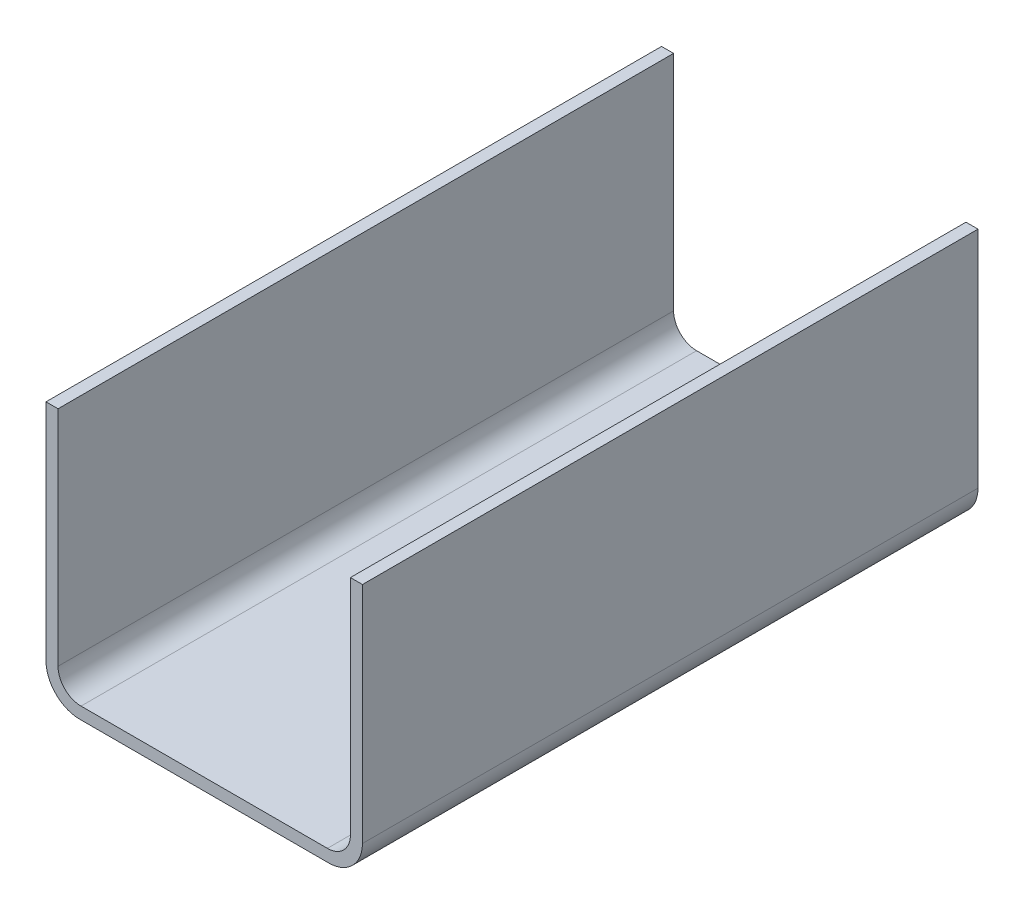
ISO-10303-21;
HEADER;
FILE_DESCRIPTION(('STEP AP214'),'2;1');
FILE_NAME('part.step','',(''),(''),'','','');
FILE_SCHEMA(('AUTOMOTIVE_DESIGN { 1 0 10303 214 1 1 1 1 }'));
ENDSEC;
DATA;
#1=APPLICATION_CONTEXT('core data for automotive mechanical design processes');
#2=APPLICATION_PROTOCOL_DEFINITION('international standard','automotive_design',2000,#1);
#3=PRODUCT_CONTEXT('',#1,'mechanical');
#4=PRODUCT('Part','Part','',(#3));
#5=PRODUCT_RELATED_PRODUCT_CATEGORY('part','',(#4));
#6=PRODUCT_DEFINITION_FORMATION('','',#4);
#7=PRODUCT_DEFINITION_CONTEXT('part definition',#1,'design');
#8=PRODUCT_DEFINITION('design','',#6,#7);
#9=PRODUCT_DEFINITION_SHAPE('','',#8);
#10=(LENGTH_UNIT() NAMED_UNIT(*) SI_UNIT(.MILLI.,.METRE.));
#11=(NAMED_UNIT(*) PLANE_ANGLE_UNIT() SI_UNIT($,.RADIAN.));
#12=(NAMED_UNIT(*) SI_UNIT($,.STERADIAN.) SOLID_ANGLE_UNIT());
#13=UNCERTAINTY_MEASURE_WITH_UNIT(LENGTH_MEASURE(1.E-05),#10,'distance_accuracy_value','');
#14=(GEOMETRIC_REPRESENTATION_CONTEXT(3) GLOBAL_UNCERTAINTY_ASSIGNED_CONTEXT((#13)) GLOBAL_UNIT_ASSIGNED_CONTEXT((#10,
#11,#12)) REPRESENTATION_CONTEXT('',''));
#15=CARTESIAN_POINT('',(0.,0.,0.));
#16=DIRECTION('',(0.,0.,1.));
#17=DIRECTION('',(1.,0.,0.));
#18=AXIS2_PLACEMENT_3D('',#15,#16,#17);
#19=CARTESIAN_POINT('',(95.35,84.15,401.5));
#20=DIRECTION('',(0.,-1.,0.));
#21=DIRECTION('',(1.,0.,0.));
#22=AXIS2_PLACEMENT_3D('',#19,#20,#21);
#23=PLANE('',#22);
#24=DIRECTION('',(-1.,0.,0.));
#25=VECTOR('',#24,1.);
#26=CARTESIAN_POINT('',(95.35,84.15,0.));
#27=LINE('',#26,#25);
#28=CARTESIAN_POINT('',(103.2,84.15,0.));
#29=VERTEX_POINT('',#28);
#30=CARTESIAN_POINT('',(95.35,84.15,0.));
#31=VERTEX_POINT('',#30);
#32=EDGE_CURVE('E148',#29,#31,#27,.T.);
#33=ORIENTED_EDGE('',*,*,#32,.T.);
#34=DIRECTION('',(0.,0.,-1.));
#35=VECTOR('',#34,1.);
#36=CARTESIAN_POINT('',(95.35,84.15,401.5));
#37=LINE('',#36,#35);
#38=CARTESIAN_POINT('',(95.35,84.15,401.5));
#39=VERTEX_POINT('',#38);
#40=EDGE_CURVE('E131',#39,#31,#37,.T.);
#41=ORIENTED_EDGE('',*,*,#40,.F.);
#42=DIRECTION('',(-1.,0.,0.));
#43=VECTOR('',#42,1.);
#44=CARTESIAN_POINT('',(95.35,84.15,401.5));
#45=LINE('',#44,#43);
#46=CARTESIAN_POINT('',(103.2,84.15,401.5));
#47=VERTEX_POINT('',#46);
#48=EDGE_CURVE('E137',#47,#39,#45,.T.);
#49=ORIENTED_EDGE('',*,*,#48,.F.);
#50=DIRECTION('',(0.,0.,-1.));
#51=VECTOR('',#50,1.);
#52=CARTESIAN_POINT('',(103.2,84.15,401.5));
#53=LINE('',#52,#51);
#54=EDGE_CURVE('E213',#47,#29,#53,.T.);
#55=ORIENTED_EDGE('',*,*,#54,.T.);
#56=EDGE_LOOP('',(#33,#41,#49,#55));
#57=FACE_BOUND('',#56,.T.);
#58=ADVANCED_FACE('F34',(#57),#23,.F.);
#59=CARTESIAN_POINT('',(95.35,-76.3,401.5));
#60=DIRECTION('',(1.,0.,0.));
#61=DIRECTION('',(0.,1.,0.));
#62=AXIS2_PLACEMENT_3D('',#59,#60,#61);
#63=PLANE('',#62);
#64=DIRECTION('',(0.,-1.,0.));
#65=VECTOR('',#64,1.);
#66=CARTESIAN_POINT('',(95.35,-76.3,0.));
#67=LINE('',#66,#65);
#68=CARTESIAN_POINT('',(95.35,-61.3,0.));
#69=VERTEX_POINT('',#68);
#70=EDGE_CURVE('E218',#31,#69,#67,.T.);
#71=ORIENTED_EDGE('',*,*,#70,.T.);
#72=DIRECTION('',(0.,0.,-1.));
#73=VECTOR('',#72,1.);
#74=CARTESIAN_POINT('',(95.35,-61.3,401.5));
#75=LINE('',#74,#73);
#76=CARTESIAN_POINT('',(95.35,-61.3,401.5));
#77=VERTEX_POINT('',#76);
#78=EDGE_CURVE('E134',#69,#77,#75,.F.);
#79=ORIENTED_EDGE('',*,*,#78,.T.);
#80=DIRECTION('',(0.,-1.,0.));
#81=VECTOR('',#80,1.);
#82=CARTESIAN_POINT('',(95.35,-76.3,401.5));
#83=LINE('',#82,#81);
#84=EDGE_CURVE('E126',#39,#77,#83,.T.);
#85=ORIENTED_EDGE('',*,*,#84,.F.);
#86=ORIENTED_EDGE('',*,*,#40,.T.);
#87=EDGE_LOOP('',(#71,#79,#85,#86));
#88=FACE_BOUND('',#87,.T.);
#89=ADVANCED_FACE('F129',(#88),#63,.F.);
#90=CARTESIAN_POINT('',(-95.35,-76.3,401.5));
#91=DIRECTION('',(0.,-1.,0.));
#92=DIRECTION('',(0.,0.,-1.));
#93=AXIS2_PLACEMENT_3D('',#90,#91,#92);
#94=PLANE('',#93);
#95=DIRECTION('',(-1.,0.,0.));
#96=VECTOR('',#95,1.);
#97=CARTESIAN_POINT('',(-95.35,-76.3,0.));
#98=LINE('',#97,#96);
#99=CARTESIAN_POINT('',(80.35,-76.3,0.));
#100=VERTEX_POINT('',#99);
#101=CARTESIAN_POINT('',(-80.35,-76.3,0.));
#102=VERTEX_POINT('',#101);
#103=EDGE_CURVE('E220',#100,#102,#98,.T.);
#104=ORIENTED_EDGE('',*,*,#103,.T.);
#105=DIRECTION('',(0.,0.,-1.));
#106=VECTOR('',#105,1.);
#107=CARTESIAN_POINT('',(-80.35,-76.3,401.5));
#108=LINE('',#107,#106);
#109=CARTESIAN_POINT('',(-80.35,-76.3,401.5));
#110=VERTEX_POINT('',#109);
#111=EDGE_CURVE('E162',#102,#110,#108,.F.);
#112=ORIENTED_EDGE('',*,*,#111,.T.);
#113=DIRECTION('',(-1.,0.,0.));
#114=VECTOR('',#113,1.);
#115=CARTESIAN_POINT('',(-95.35,-76.3,401.5));
#116=LINE('',#115,#114);
#117=CARTESIAN_POINT('',(80.35,-76.3,401.5));
#118=VERTEX_POINT('',#117);
#119=EDGE_CURVE('E136',#118,#110,#116,.T.);
#120=ORIENTED_EDGE('',*,*,#119,.F.);
#121=DIRECTION('',(0.,0.,-1.));
#122=VECTOR('',#121,1.);
#123=CARTESIAN_POINT('',(80.35,-76.3,0.));
#124=LINE('',#123,#122);
#125=EDGE_CURVE('E153',#118,#100,#124,.T.);
#126=ORIENTED_EDGE('',*,*,#125,.T.);
#127=EDGE_LOOP('',(#104,#112,#120,#126));
#128=FACE_BOUND('',#127,.T.);
#129=ADVANCED_FACE('F245',(#128),#94,.F.);
#130=CARTESIAN_POINT('',(-95.35,84.15,401.5));
#131=DIRECTION('',(-1.,0.,0.));
#132=DIRECTION('',(0.,-1.,0.));
#133=AXIS2_PLACEMENT_3D('',#130,#131,#132);
#134=PLANE('',#133);
#135=DIRECTION('',(0.,1.,0.));
#136=VECTOR('',#135,1.);
#137=CARTESIAN_POINT('',(-95.35,84.15,401.5));
#138=LINE('',#137,#136);
#139=CARTESIAN_POINT('',(-95.35,-61.3,401.5));
#140=VERTEX_POINT('',#139);
#141=CARTESIAN_POINT('',(-95.35,84.15,401.5));
#142=VERTEX_POINT('',#141);
#143=EDGE_CURVE('E232',#140,#142,#138,.T.);
#144=ORIENTED_EDGE('',*,*,#143,.F.);
#145=DIRECTION('',(0.,0.,-1.));
#146=VECTOR('',#145,1.);
#147=CARTESIAN_POINT('',(-95.35,-61.3,0.));
#148=LINE('',#147,#146);
#149=CARTESIAN_POINT('',(-95.35,-61.3,0.));
#150=VERTEX_POINT('',#149);
#151=EDGE_CURVE('E149',#140,#150,#148,.T.);
#152=ORIENTED_EDGE('',*,*,#151,.T.);
#153=DIRECTION('',(0.,1.,0.));
#154=VECTOR('',#153,1.);
#155=CARTESIAN_POINT('',(-95.35,84.15,0.));
#156=LINE('',#155,#154);
#157=CARTESIAN_POINT('',(-95.35,84.15,0.));
#158=VERTEX_POINT('',#157);
#159=EDGE_CURVE('E208',#150,#158,#156,.T.);
#160=ORIENTED_EDGE('',*,*,#159,.T.);
#161=DIRECTION('',(0.,0.,-1.));
#162=VECTOR('',#161,1.);
#163=CARTESIAN_POINT('',(-95.35,84.15,401.5));
#164=LINE('',#163,#162);
#165=EDGE_CURVE('E150',#142,#158,#164,.T.);
#166=ORIENTED_EDGE('',*,*,#165,.F.);
#167=EDGE_LOOP('',(#144,#152,#160,#166));
#168=FACE_BOUND('',#167,.T.);
#169=ADVANCED_FACE('F226',(#168),#134,.F.);
#170=CARTESIAN_POINT('',(-103.2,84.15,401.5));
#171=DIRECTION('',(0.,-1.,0.));
#172=DIRECTION('',(0.,0.,-1.));
#173=AXIS2_PLACEMENT_3D('',#170,#171,#172);
#174=PLANE('',#173);
#175=DIRECTION('',(-1.,0.,0.));
#176=VECTOR('',#175,1.);
#177=CARTESIAN_POINT('',(-103.2,84.15,0.));
#178=LINE('',#177,#176);
#179=CARTESIAN_POINT('',(-103.2,84.15,0.));
#180=VERTEX_POINT('',#179);
#181=EDGE_CURVE('E205',#158,#180,#178,.T.);
#182=ORIENTED_EDGE('',*,*,#181,.T.);
#183=DIRECTION('',(0.,0.,-1.));
#184=VECTOR('',#183,1.);
#185=CARTESIAN_POINT('',(-103.2,84.15,401.5));
#186=LINE('',#185,#184);
#187=CARTESIAN_POINT('',(-103.2,84.15,401.5));
#188=VERTEX_POINT('',#187);
#189=EDGE_CURVE('E156',#188,#180,#186,.T.);
#190=ORIENTED_EDGE('',*,*,#189,.F.);
#191=DIRECTION('',(-1.,0.,0.));
#192=VECTOR('',#191,1.);
#193=CARTESIAN_POINT('',(-103.2,84.15,401.5));
#194=LINE('',#193,#192);
#195=EDGE_CURVE('E231',#142,#188,#194,.T.);
#196=ORIENTED_EDGE('',*,*,#195,.F.);
#197=ORIENTED_EDGE('',*,*,#165,.T.);
#198=EDGE_LOOP('',(#182,#190,#196,#197));
#199=FACE_BOUND('',#198,.T.);
#200=ADVANCED_FACE('F230',(#199),#174,.F.);
#201=CARTESIAN_POINT('',(-103.2,-84.15,401.5));
#202=DIRECTION('',(1.,0.,0.));
#203=DIRECTION('',(0.,0.,-1.));
#204=AXIS2_PLACEMENT_3D('',#201,#202,#203);
#205=PLANE('',#204);
#206=DIRECTION('',(0.,-1.,0.));
#207=VECTOR('',#206,1.);
#208=CARTESIAN_POINT('',(-103.2,-84.15,0.));
#209=LINE('',#208,#207);
#210=CARTESIAN_POINT('',(-103.2,-62.15,0.));
#211=VERTEX_POINT('',#210);
#212=EDGE_CURVE('E200',#180,#211,#209,.T.);
#213=ORIENTED_EDGE('',*,*,#212,.T.);
#214=DIRECTION('',(0.,0.,-1.));
#215=VECTOR('',#214,1.);
#216=CARTESIAN_POINT('',(-103.2,-62.15,401.5));
#217=LINE('',#216,#215);
#218=CARTESIAN_POINT('',(-103.2,-62.15,401.5));
#219=VERTEX_POINT('',#218);
#220=EDGE_CURVE('E57',#211,#219,#217,.F.);
#221=ORIENTED_EDGE('',*,*,#220,.T.);
#222=DIRECTION('',(0.,-1.,0.));
#223=VECTOR('',#222,1.);
#224=CARTESIAN_POINT('',(-103.2,-84.15,401.5));
#225=LINE('',#224,#223);
#226=EDGE_CURVE('E186',#188,#219,#225,.T.);
#227=ORIENTED_EDGE('',*,*,#226,.F.);
#228=ORIENTED_EDGE('',*,*,#189,.T.);
#229=EDGE_LOOP('',(#213,#221,#227,#228));
#230=FACE_BOUND('',#229,.T.);
#231=ADVANCED_FACE('F203',(#230),#205,.F.);
#232=CARTESIAN_POINT('',(-103.2,-84.15,401.5));
#233=DIRECTION('',(0.,1.,0.));
#234=DIRECTION('',(0.,0.,1.));
#235=AXIS2_PLACEMENT_3D('',#232,#233,#234);
#236=PLANE('',#235);
#237=DIRECTION('',(1.,0.,0.));
#238=VECTOR('',#237,1.);
#239=CARTESIAN_POINT('',(-103.2,-84.15,401.5));
#240=LINE('',#239,#238);
#241=CARTESIAN_POINT('',(-81.2,-84.15,401.5));
#242=VERTEX_POINT('',#241);
#243=CARTESIAN_POINT('',(81.1999999999999,-84.15,401.5));
#244=VERTEX_POINT('',#243);
#245=EDGE_CURVE('E185',#242,#244,#240,.T.);
#246=ORIENTED_EDGE('',*,*,#245,.F.);
#247=DIRECTION('',(0.,0.,-1.));
#248=VECTOR('',#247,1.);
#249=CARTESIAN_POINT('',(-81.2,-84.15,401.5));
#250=LINE('',#249,#248);
#251=CARTESIAN_POINT('',(-81.2,-84.15,0.));
#252=VERTEX_POINT('',#251);
#253=EDGE_CURVE('E175',#242,#252,#250,.T.);
#254=ORIENTED_EDGE('',*,*,#253,.T.);
#255=DIRECTION('',(1.,0.,0.));
#256=VECTOR('',#255,1.);
#257=CARTESIAN_POINT('',(-103.2,-84.15,0.));
#258=LINE('',#257,#256);
#259=CARTESIAN_POINT('',(81.1999999999999,-84.15,0.));
#260=VERTEX_POINT('',#259);
#261=EDGE_CURVE('E201',#252,#260,#258,.T.);
#262=ORIENTED_EDGE('',*,*,#261,.T.);
#263=DIRECTION('',(0.,0.,-1.));
#264=VECTOR('',#263,1.);
#265=CARTESIAN_POINT('',(81.2,-84.15,401.5));
#266=LINE('',#265,#264);
#267=EDGE_CURVE('E173',#260,#244,#266,.F.);
#268=ORIENTED_EDGE('',*,*,#267,.T.);
#269=EDGE_LOOP('',(#246,#254,#262,#268));
#270=FACE_BOUND('',#269,.T.);
#271=ADVANCED_FACE('F190',(#270),#236,.F.);
#272=CARTESIAN_POINT('',(103.2,-84.15,401.5));
#273=DIRECTION('',(-1.,0.,0.));
#274=DIRECTION('',(0.,0.,1.));
#275=AXIS2_PLACEMENT_3D('',#272,#273,#274);
#276=PLANE('',#275);
#277=DIRECTION('',(0.,1.,0.));
#278=VECTOR('',#277,1.);
#279=CARTESIAN_POINT('',(103.2,-84.15,401.5));
#280=LINE('',#279,#278);
#281=CARTESIAN_POINT('',(103.2,-62.15,401.5));
#282=VERTEX_POINT('',#281);
#283=EDGE_CURVE('E141',#282,#47,#280,.T.);
#284=ORIENTED_EDGE('',*,*,#283,.F.);
#285=DIRECTION('',(0.,0.,-1.));
#286=VECTOR('',#285,1.);
#287=CARTESIAN_POINT('',(103.2,-62.15,401.5));
#288=LINE('',#287,#286);
#289=CARTESIAN_POINT('',(103.2,-62.15,0.));
#290=VERTEX_POINT('',#289);
#291=EDGE_CURVE('E11',#282,#290,#288,.T.);
#292=ORIENTED_EDGE('',*,*,#291,.T.);
#293=DIRECTION('',(0.,1.,0.));
#294=VECTOR('',#293,1.);
#295=CARTESIAN_POINT('',(103.2,-84.15,0.));
#296=LINE('',#295,#294);
#297=EDGE_CURVE('E145',#290,#29,#296,.T.);
#298=ORIENTED_EDGE('',*,*,#297,.T.);
#299=ORIENTED_EDGE('',*,*,#54,.F.);
#300=EDGE_LOOP('',(#284,#292,#298,#299));
#301=FACE_BOUND('',#300,.T.);
#302=ADVANCED_FACE('F250',(#301),#276,.F.);
#303=CARTESIAN_POINT('',(0.,0.,401.5));
#304=DIRECTION('',(0.,0.,1.));
#305=DIRECTION('',(1.,0.,0.));
#306=AXIS2_PLACEMENT_3D('',#303,#304,#305);
#307=PLANE('',#306);
#308=ORIENTED_EDGE('',*,*,#226,.T.);
#309=CARTESIAN_POINT('',(-81.2,-62.15,401.5));
#310=DIRECTION('',(0.,0.,1.));
#311=DIRECTION('',(1.,0.,0.));
#312=AXIS2_PLACEMENT_3D('',#309,#310,#311);
#313=CIRCLE('',#312,22.);
#314=EDGE_CURVE('E42',#219,#242,#313,.T.);
#315=ORIENTED_EDGE('',*,*,#314,.T.);
#316=ORIENTED_EDGE('',*,*,#245,.T.);
#317=CARTESIAN_POINT('',(81.2,-62.15,401.5));
#318=DIRECTION('',(0.,0.,1.));
#319=DIRECTION('',(1.,0.,0.));
#320=AXIS2_PLACEMENT_3D('',#317,#318,#319);
#321=CIRCLE('',#320,22.);
#322=EDGE_CURVE('E49',#244,#282,#321,.T.);
#323=ORIENTED_EDGE('',*,*,#322,.T.);
#324=ORIENTED_EDGE('',*,*,#283,.T.);
#325=ORIENTED_EDGE('',*,*,#48,.T.);
#326=ORIENTED_EDGE('',*,*,#84,.T.);
#327=CARTESIAN_POINT('',(80.35,-61.3,401.5));
#328=DIRECTION('',(0.,0.,1.));
#329=DIRECTION('',(1.,0.,0.));
#330=AXIS2_PLACEMENT_3D('',#327,#328,#329);
#331=CIRCLE('',#330,15.);
#332=EDGE_CURVE('E171',#77,#118,#331,.F.);
#333=ORIENTED_EDGE('',*,*,#332,.T.);
#334=ORIENTED_EDGE('',*,*,#119,.T.);
#335=CARTESIAN_POINT('',(-80.35,-61.3,401.5));
#336=DIRECTION('',(0.,0.,1.));
#337=DIRECTION('',(1.,0.,0.));
#338=AXIS2_PLACEMENT_3D('',#335,#336,#337);
#339=CIRCLE('',#338,15.);
#340=EDGE_CURVE('E167',#110,#140,#339,.F.);
#341=ORIENTED_EDGE('',*,*,#340,.T.);
#342=ORIENTED_EDGE('',*,*,#143,.T.);
#343=ORIENTED_EDGE('',*,*,#195,.T.);
#344=EDGE_LOOP('',(#308,#315,#316,#323,#324,#325,#326,#333,#334,#341,#342,#343));
#345=FACE_BOUND('',#344,.T.);
#346=ADVANCED_FACE('F140',(#345),#307,.T.);
#347=CARTESIAN_POINT('',(0.,0.,0.));
#348=DIRECTION('',(0.,0.,1.));
#349=DIRECTION('',(1.,0.,0.));
#350=AXIS2_PLACEMENT_3D('',#347,#348,#349);
#351=PLANE('',#350);
#352=ORIENTED_EDGE('',*,*,#261,.F.);
#353=CARTESIAN_POINT('',(-81.2,-62.15,0.));
#354=DIRECTION('',(0.,0.,1.));
#355=DIRECTION('',(1.,0.,0.));
#356=AXIS2_PLACEMENT_3D('',#353,#354,#355);
#357=CIRCLE('',#356,22.);
#358=EDGE_CURVE('E180',#252,#211,#357,.F.);
#359=ORIENTED_EDGE('',*,*,#358,.T.);
#360=ORIENTED_EDGE('',*,*,#212,.F.);
#361=ORIENTED_EDGE('',*,*,#181,.F.);
#362=ORIENTED_EDGE('',*,*,#159,.F.);
#363=CARTESIAN_POINT('',(-80.35,-61.3,0.));
#364=DIRECTION('',(0.,0.,1.));
#365=DIRECTION('',(1.,0.,0.));
#366=AXIS2_PLACEMENT_3D('',#363,#364,#365);
#367=CIRCLE('',#366,15.);
#368=EDGE_CURVE('E165',#150,#102,#367,.T.);
#369=ORIENTED_EDGE('',*,*,#368,.T.);
#370=ORIENTED_EDGE('',*,*,#103,.F.);
#371=CARTESIAN_POINT('',(80.35,-61.3,0.));
#372=DIRECTION('',(0.,0.,1.));
#373=DIRECTION('',(1.,0.,0.));
#374=AXIS2_PLACEMENT_3D('',#371,#372,#373);
#375=CIRCLE('',#374,15.);
#376=EDGE_CURVE('E169',#100,#69,#375,.T.);
#377=ORIENTED_EDGE('',*,*,#376,.T.);
#378=ORIENTED_EDGE('',*,*,#70,.F.);
#379=ORIENTED_EDGE('',*,*,#32,.F.);
#380=ORIENTED_EDGE('',*,*,#297,.F.);
#381=CARTESIAN_POINT('',(81.2,-62.15,0.));
#382=DIRECTION('',(0.,0.,1.));
#383=DIRECTION('',(1.,0.,0.));
#384=AXIS2_PLACEMENT_3D('',#381,#382,#383);
#385=CIRCLE('',#384,22.);
#386=EDGE_CURVE('E178',#290,#260,#385,.F.);
#387=ORIENTED_EDGE('',*,*,#386,.T.);
#388=EDGE_LOOP('',(#352,#359,#360,#361,#362,#369,#370,#377,#378,#379,#380,#387));
#389=FACE_BOUND('',#388,.T.);
#390=ADVANCED_FACE('F198',(#389),#351,.F.);
#391=CARTESIAN_POINT('',(-80.35,-61.3,401.5));
#392=DIRECTION('',(0.,0.,1.));
#393=DIRECTION('',(1.,0.,0.));
#394=AXIS2_PLACEMENT_3D('',#391,#392,#393);
#395=CYLINDRICAL_SURFACE('',#394,15.);
#396=ORIENTED_EDGE('',*,*,#340,.F.);
#397=ORIENTED_EDGE('',*,*,#111,.F.);
#398=ORIENTED_EDGE('',*,*,#368,.F.);
#399=ORIENTED_EDGE('',*,*,#151,.F.);
#400=EDGE_LOOP('',(#396,#397,#398,#399));
#401=FACE_BOUND('',#400,.T.);
#402=ADVANCED_FACE('F243',(#401),#395,.F.);
#403=CARTESIAN_POINT('',(80.35,-61.3,401.5));
#404=DIRECTION('',(0.,0.,1.));
#405=DIRECTION('',(1.,0.,0.));
#406=AXIS2_PLACEMENT_3D('',#403,#404,#405);
#407=CYLINDRICAL_SURFACE('',#406,15.);
#408=ORIENTED_EDGE('',*,*,#332,.F.);
#409=ORIENTED_EDGE('',*,*,#78,.F.);
#410=ORIENTED_EDGE('',*,*,#376,.F.);
#411=ORIENTED_EDGE('',*,*,#125,.F.);
#412=EDGE_LOOP('',(#408,#409,#410,#411));
#413=FACE_BOUND('',#412,.T.);
#414=ADVANCED_FACE('F247',(#413),#407,.F.);
#415=CARTESIAN_POINT('',(-81.2,-62.15,401.5));
#416=DIRECTION('',(0.,0.,-1.));
#417=DIRECTION('',(-1.,0.,0.));
#418=AXIS2_PLACEMENT_3D('',#415,#416,#417);
#419=CYLINDRICAL_SURFACE('',#418,22.);
#420=ORIENTED_EDGE('',*,*,#314,.F.);
#421=ORIENTED_EDGE('',*,*,#220,.F.);
#422=ORIENTED_EDGE('',*,*,#358,.F.);
#423=ORIENTED_EDGE('',*,*,#253,.F.);
#424=EDGE_LOOP('',(#420,#421,#422,#423));
#425=FACE_BOUND('',#424,.T.);
#426=ADVANCED_FACE('F195',(#425),#419,.T.);
#427=CARTESIAN_POINT('',(81.2,-62.15,401.5));
#428=DIRECTION('',(0.,0.,-1.));
#429=DIRECTION('',(-1.,0.,0.));
#430=AXIS2_PLACEMENT_3D('',#427,#428,#429);
#431=CYLINDRICAL_SURFACE('',#430,22.);
#432=ORIENTED_EDGE('',*,*,#322,.F.);
#433=ORIENTED_EDGE('',*,*,#267,.F.);
#434=ORIENTED_EDGE('',*,*,#386,.F.);
#435=ORIENTED_EDGE('',*,*,#291,.F.);
#436=EDGE_LOOP('',(#432,#433,#434,#435));
#437=FACE_BOUND('',#436,.T.);
#438=ADVANCED_FACE('F36',(#437),#431,.T.);
#439=CLOSED_SHELL('',(#58,#89,#129,#169,#200,#231,#271,#302,#346,#390,#402,#414,#426,#438));
#440=MANIFOLD_SOLID_BREP('B2',#439);
#441=ADVANCED_BREP_SHAPE_REPRESENTATION('',(#18,#440),#14);
#442=SHAPE_DEFINITION_REPRESENTATION(#9,#441);
ENDSEC;
END-ISO-10303-21;
